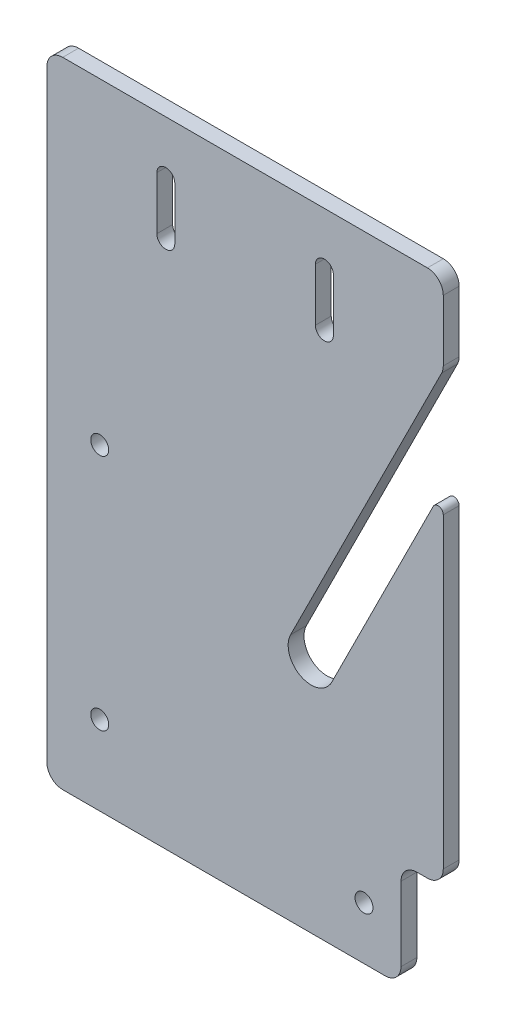
ISO-10303-21;
HEADER;
FILE_DESCRIPTION(('STEP AP214'),'2;1');
FILE_NAME('part.step','',(''),(''),'','','');
FILE_SCHEMA(('AUTOMOTIVE_DESIGN { 1 0 10303 214 1 1 1 1 }'));
ENDSEC;
DATA;
#1=APPLICATION_CONTEXT('core data for automotive mechanical design processes');
#2=APPLICATION_PROTOCOL_DEFINITION('international standard','automotive_design',2000,#1);
#3=PRODUCT_CONTEXT('',#1,'mechanical');
#4=PRODUCT('Part','Part','',(#3));
#5=PRODUCT_RELATED_PRODUCT_CATEGORY('part','',(#4));
#6=PRODUCT_DEFINITION_FORMATION('','',#4);
#7=PRODUCT_DEFINITION_CONTEXT('part definition',#1,'design');
#8=PRODUCT_DEFINITION('design','',#6,#7);
#9=PRODUCT_DEFINITION_SHAPE('','',#8);
#10=(LENGTH_UNIT() NAMED_UNIT(*) SI_UNIT(.MILLI.,.METRE.));
#11=(NAMED_UNIT(*) PLANE_ANGLE_UNIT() SI_UNIT($,.RADIAN.));
#12=(NAMED_UNIT(*) SI_UNIT($,.STERADIAN.) SOLID_ANGLE_UNIT());
#13=UNCERTAINTY_MEASURE_WITH_UNIT(LENGTH_MEASURE(1.E-05),#10,'distance_accuracy_value','');
#14=(GEOMETRIC_REPRESENTATION_CONTEXT(3) GLOBAL_UNCERTAINTY_ASSIGNED_CONTEXT((#13)) GLOBAL_UNIT_ASSIGNED_CONTEXT((#10,
#11,#12)) REPRESENTATION_CONTEXT('',''));
#15=CARTESIAN_POINT('',(0.,0.,0.));
#16=DIRECTION('',(0.,0.,1.));
#17=DIRECTION('',(1.,0.,0.));
#18=AXIS2_PLACEMENT_3D('',#15,#16,#17);
#19=CARTESIAN_POINT('',(50.,-75.,3.));
#20=DIRECTION('',(0.,0.,-1.));
#21=DIRECTION('',(-1.,0.,0.));
#22=AXIS2_PLACEMENT_3D('',#19,#20,#21);
#23=CYLINDRICAL_SURFACE('',#22,4.35);
#24=CARTESIAN_POINT('',(50.,-75.,0.));
#25=DIRECTION('',(0.,0.,1.));
#26=DIRECTION('',(1.,0.,0.));
#27=AXIS2_PLACEMENT_3D('',#24,#25,#26);
#28=CIRCLE('',#27,4.35);
#29=CARTESIAN_POINT('',(46.1092417191504,-73.0546208595752,0.));
#30=VERTEX_POINT('',#29);
#31=CARTESIAN_POINT('',(53.8907582808496,-76.9453791404248,0.));
#32=VERTEX_POINT('',#31);
#33=EDGE_CURVE('E329',#30,#32,#28,.T.);
#34=ORIENTED_EDGE('',*,*,#33,.F.);
#35=DIRECTION('',(0.,0.,-1.));
#36=VECTOR('',#35,1.);
#37=CARTESIAN_POINT('',(46.1092417191504,-73.0546208595752,3.));
#38=LINE('',#37,#36);
#39=CARTESIAN_POINT('',(46.1092417191504,-73.0546208595752,3.));
#40=VERTEX_POINT('',#39);
#41=EDGE_CURVE('E348',#40,#30,#38,.T.);
#42=ORIENTED_EDGE('',*,*,#41,.F.);
#43=CARTESIAN_POINT('',(50.,-75.,3.));
#44=DIRECTION('',(0.,0.,1.));
#45=DIRECTION('',(1.,0.,0.));
#46=AXIS2_PLACEMENT_3D('',#43,#44,#45);
#47=CIRCLE('',#46,4.35);
#48=CARTESIAN_POINT('',(53.8907582808496,-76.9453791404248,3.));
#49=VERTEX_POINT('',#48);
#50=EDGE_CURVE('E300',#40,#49,#47,.T.);
#51=ORIENTED_EDGE('',*,*,#50,.T.);
#52=DIRECTION('',(0.,0.,-1.));
#53=VECTOR('',#52,1.);
#54=CARTESIAN_POINT('',(53.8907582808496,-76.9453791404248,3.));
#55=LINE('',#54,#53);
#56=EDGE_CURVE('E320',#49,#32,#55,.T.);
#57=ORIENTED_EDGE('',*,*,#56,.T.);
#58=EDGE_LOOP('',(#34,#42,#51,#57));
#59=FACE_BOUND('',#58,.T.);
#60=ADVANCED_FACE('F37',(#59),#23,.F.);
#61=CARTESIAN_POINT('',(66.1092417191504,-33.0546208595752,3.));
#62=DIRECTION('',(0.894427190999916,-0.447213595499958,0.));
#63=DIRECTION('',(0.447213595499958,0.894427190999916,0.));
#64=AXIS2_PLACEMENT_3D('',#61,#62,#63);
#65=PLANE('',#64);
#66=DIRECTION('',(-0.447213595499958,-0.894427190999916,0.));
#67=VECTOR('',#66,1.);
#68=CARTESIAN_POINT('',(66.1092417191504,-33.0546208595752,0.));
#69=LINE('',#68,#67);
#70=CARTESIAN_POINT('',(74.6832815729997,-15.9065411518764,0.));
#71=VERTEX_POINT('',#70);
#72=EDGE_CURVE('E332',#71,#30,#69,.T.);
#73=ORIENTED_EDGE('',*,*,#72,.F.);
#74=DIRECTION('',(0.,0.,-1.));
#75=VECTOR('',#74,1.);
#76=CARTESIAN_POINT('',(74.6832815729997,-15.9065411518764,3.));
#77=LINE('',#76,#75);
#78=CARTESIAN_POINT('',(74.6832815729997,-15.9065411518764,3.));
#79=VERTEX_POINT('',#78);
#80=EDGE_CURVE('E364',#71,#79,#77,.F.);
#81=ORIENTED_EDGE('',*,*,#80,.T.);
#82=DIRECTION('',(-0.447213595499958,-0.894427190999916,0.));
#83=VECTOR('',#82,1.);
#84=CARTESIAN_POINT('',(66.1092417191504,-33.0546208595752,3.));
#85=LINE('',#84,#83);
#86=EDGE_CURVE('E303',#79,#40,#85,.T.);
#87=ORIENTED_EDGE('',*,*,#86,.T.);
#88=ORIENTED_EDGE('',*,*,#41,.T.);
#89=EDGE_LOOP('',(#73,#81,#87,#88));
#90=FACE_BOUND('',#89,.T.);
#91=ADVANCED_FACE('F441',(#90),#65,.T.);
#92=CARTESIAN_POINT('',(75.,0.,3.));
#93=DIRECTION('',(-1.,0.,0.));
#94=DIRECTION('',(0.,0.,1.));
#95=AXIS2_PLACEMENT_3D('',#92,#93,#94);
#96=PLANE('',#95);
#97=DIRECTION('',(0.,1.,0.));
#98=VECTOR('',#97,1.);
#99=CARTESIAN_POINT('',(75.,0.,3.));
#100=LINE('',#99,#98);
#101=CARTESIAN_POINT('',(75.,-14.5649003653766,3.));
#102=VERTEX_POINT('',#101);
#103=CARTESIAN_POINT('',(75.,-3.,3.));
#104=VERTEX_POINT('',#103);
#105=EDGE_CURVE('E305',#102,#104,#100,.T.);
#106=ORIENTED_EDGE('',*,*,#105,.F.);
#107=DIRECTION('',(0.,0.,-1.));
#108=VECTOR('',#107,1.);
#109=CARTESIAN_POINT('',(75.,-14.5649003653766,0.));
#110=LINE('',#109,#108);
#111=CARTESIAN_POINT('',(75.,-14.5649003653766,0.));
#112=VERTEX_POINT('',#111);
#113=EDGE_CURVE('E353',#102,#112,#110,.T.);
#114=ORIENTED_EDGE('',*,*,#113,.T.);
#115=DIRECTION('',(0.,1.,0.));
#116=VECTOR('',#115,1.);
#117=CARTESIAN_POINT('',(75.,0.,0.));
#118=LINE('',#117,#116);
#119=CARTESIAN_POINT('',(75.,-3.,0.));
#120=VERTEX_POINT('',#119);
#121=EDGE_CURVE('E334',#112,#120,#118,.T.);
#122=ORIENTED_EDGE('',*,*,#121,.T.);
#123=DIRECTION('',(0.,0.,-1.));
#124=VECTOR('',#123,1.);
#125=CARTESIAN_POINT('',(75.,-3.,3.));
#126=LINE('',#125,#124);
#127=EDGE_CURVE('E351',#120,#104,#126,.F.);
#128=ORIENTED_EDGE('',*,*,#127,.T.);
#129=EDGE_LOOP('',(#106,#114,#122,#128));
#130=FACE_BOUND('',#129,.T.);
#131=ADVANCED_FACE('F446',(#130),#96,.F.);
#132=CARTESIAN_POINT('',(0.,0.,3.));
#133=DIRECTION('',(0.,-1.,0.));
#134=DIRECTION('',(1.,0.,0.));
#135=AXIS2_PLACEMENT_3D('',#132,#133,#134);
#136=PLANE('',#135);
#137=DIRECTION('',(-1.,0.,0.));
#138=VECTOR('',#137,1.);
#139=CARTESIAN_POINT('',(0.,0.,3.));
#140=LINE('',#139,#138);
#141=CARTESIAN_POINT('',(72.,0.,3.));
#142=VERTEX_POINT('',#141);
#143=CARTESIAN_POINT('',(3.,0.,3.));
#144=VERTEX_POINT('',#143);
#145=EDGE_CURVE('E310',#142,#144,#140,.T.);
#146=ORIENTED_EDGE('',*,*,#145,.F.);
#147=DIRECTION('',(0.,0.,-1.));
#148=VECTOR('',#147,1.);
#149=CARTESIAN_POINT('',(72.,0.,3.));
#150=LINE('',#149,#148);
#151=CARTESIAN_POINT('',(72.,0.,0.));
#152=VERTEX_POINT('',#151);
#153=EDGE_CURVE('E384',#142,#152,#150,.T.);
#154=ORIENTED_EDGE('',*,*,#153,.T.);
#155=DIRECTION('',(-1.,0.,0.));
#156=VECTOR('',#155,1.);
#157=CARTESIAN_POINT('',(0.,0.,0.));
#158=LINE('',#157,#156);
#159=CARTESIAN_POINT('',(3.,0.,0.));
#160=VERTEX_POINT('',#159);
#161=EDGE_CURVE('E338',#152,#160,#158,.T.);
#162=ORIENTED_EDGE('',*,*,#161,.T.);
#163=DIRECTION('',(0.,0.,-1.));
#164=VECTOR('',#163,1.);
#165=CARTESIAN_POINT('',(3.,0.,3.));
#166=LINE('',#165,#164);
#167=EDGE_CURVE('E382',#160,#144,#166,.F.);
#168=ORIENTED_EDGE('',*,*,#167,.T.);
#169=EDGE_LOOP('',(#146,#154,#162,#168));
#170=FACE_BOUND('',#169,.T.);
#171=ADVANCED_FACE('F528',(#170),#136,.F.);
#172=CARTESIAN_POINT('',(0.,0.,3.));
#173=DIRECTION('',(1.,0.,0.));
#174=DIRECTION('',(0.,1.,0.));
#175=AXIS2_PLACEMENT_3D('',#172,#173,#174);
#176=PLANE('',#175);
#177=DIRECTION('',(0.,-1.,0.));
#178=VECTOR('',#177,1.);
#179=CARTESIAN_POINT('',(0.,0.,0.));
#180=LINE('',#179,#178);
#181=CARTESIAN_POINT('',(0.,-3.,0.));
#182=VERTEX_POINT('',#181);
#183=CARTESIAN_POINT('',(0.,-117.,0.));
#184=VERTEX_POINT('',#183);
#185=EDGE_CURVE('E341',#182,#184,#180,.T.);
#186=ORIENTED_EDGE('',*,*,#185,.T.);
#187=DIRECTION('',(0.,0.,-1.));
#188=VECTOR('',#187,1.);
#189=CARTESIAN_POINT('',(0.,-117.,3.));
#190=LINE('',#189,#188);
#191=CARTESIAN_POINT('',(0.,-117.,3.));
#192=VERTEX_POINT('',#191);
#193=EDGE_CURVE('E380',#184,#192,#190,.F.);
#194=ORIENTED_EDGE('',*,*,#193,.T.);
#195=DIRECTION('',(0.,-1.,0.));
#196=VECTOR('',#195,1.);
#197=CARTESIAN_POINT('',(0.,0.,3.));
#198=LINE('',#197,#196);
#199=CARTESIAN_POINT('',(0.,-3.,3.));
#200=VERTEX_POINT('',#199);
#201=EDGE_CURVE('E313',#200,#192,#198,.T.);
#202=ORIENTED_EDGE('',*,*,#201,.F.);
#203=DIRECTION('',(0.,0.,-1.));
#204=VECTOR('',#203,1.);
#205=CARTESIAN_POINT('',(0.,-3.,3.));
#206=LINE('',#205,#204);
#207=EDGE_CURVE('E377',#200,#182,#206,.T.);
#208=ORIENTED_EDGE('',*,*,#207,.T.);
#209=EDGE_LOOP('',(#186,#194,#202,#208));
#210=FACE_BOUND('',#209,.T.);
#211=ADVANCED_FACE('F520',(#210),#176,.F.);
#212=CARTESIAN_POINT('',(0.,-120.,3.));
#213=DIRECTION('',(0.,1.,0.));
#214=DIRECTION('',(0.,0.,1.));
#215=AXIS2_PLACEMENT_3D('',#212,#213,#214);
#216=PLANE('',#215);
#217=DIRECTION('',(1.,0.,0.));
#218=VECTOR('',#217,1.);
#219=CARTESIAN_POINT('',(0.,-120.,0.));
#220=LINE('',#219,#218);
#221=CARTESIAN_POINT('',(3.00000000000001,-120.,0.));
#222=VERTEX_POINT('',#221);
#223=CARTESIAN_POINT('',(64.,-120.,0.));
#224=VERTEX_POINT('',#223);
#225=EDGE_CURVE('E337',#222,#224,#220,.T.);
#226=ORIENTED_EDGE('',*,*,#225,.T.);
#227=DIRECTION('',(0.,0.,1.));
#228=VECTOR('',#227,1.);
#229=CARTESIAN_POINT('',(64.,-120.,3.));
#230=LINE('',#229,#228);
#231=CARTESIAN_POINT('',(64.,-120.,3.));
#232=VERTEX_POINT('',#231);
#233=EDGE_CURVE('E407',#224,#232,#230,.T.);
#234=ORIENTED_EDGE('',*,*,#233,.T.);
#235=DIRECTION('',(1.,0.,0.));
#236=VECTOR('',#235,1.);
#237=CARTESIAN_POINT('',(0.,-120.,3.));
#238=LINE('',#237,#236);
#239=CARTESIAN_POINT('',(3.00000000000001,-120.,3.));
#240=VERTEX_POINT('',#239);
#241=EDGE_CURVE('E309',#240,#232,#238,.T.);
#242=ORIENTED_EDGE('',*,*,#241,.F.);
#243=DIRECTION('',(0.,0.,-1.));
#244=VECTOR('',#243,1.);
#245=CARTESIAN_POINT('',(3.00000000000001,-120.,3.));
#246=LINE('',#245,#244);
#247=EDGE_CURVE('E374',#240,#222,#246,.T.);
#248=ORIENTED_EDGE('',*,*,#247,.T.);
#249=EDGE_LOOP('',(#226,#234,#242,#248));
#250=FACE_BOUND('',#249,.T.);
#251=ADVANCED_FACE('F513',(#250),#216,.F.);
#252=CARTESIAN_POINT('',(75.,-97.,0.));
#253=VERTEX_POINT('',#252);
#254=CARTESIAN_POINT('',(75.,-38.9629636796239,0.));
#255=VERTEX_POINT('',#254);
#256=EDGE_CURVE('E335',#253,#255,#118,.T.);
#257=ORIENTED_EDGE('',*,*,#256,.T.);
#258=DIRECTION('',(0.,0.,-1.));
#259=VECTOR('',#258,1.);
#260=CARTESIAN_POINT('',(75.,-38.9629636796239,3.));
#261=LINE('',#260,#259);
#262=CARTESIAN_POINT('',(75.,-38.9629636796239,3.));
#263=VERTEX_POINT('',#262);
#264=EDGE_CURVE('E45',#255,#263,#261,.F.);
#265=ORIENTED_EDGE('',*,*,#264,.T.);
#266=CARTESIAN_POINT('',(75.,-97.,3.));
#267=VERTEX_POINT('',#266);
#268=EDGE_CURVE('E306',#267,#263,#100,.T.);
#269=ORIENTED_EDGE('',*,*,#268,.F.);
#270=DIRECTION('',(0.,0.,1.));
#271=VECTOR('',#270,1.);
#272=CARTESIAN_POINT('',(75.,-97.,3.));
#273=LINE('',#272,#271);
#274=EDGE_CURVE('E396',#267,#253,#273,.F.);
#275=ORIENTED_EDGE('',*,*,#274,.T.);
#276=EDGE_LOOP('',(#257,#265,#269,#275));
#277=FACE_BOUND('',#276,.T.);
#278=ADVANCED_FACE('F455',(#277),#96,.F.);
#279=CARTESIAN_POINT('',(60.,-110.,3.));
#280=DIRECTION('',(0.,0.,-1.));
#281=DIRECTION('',(-1.,0.,0.));
#282=AXIS2_PLACEMENT_3D('',#279,#280,#281);
#283=CYLINDRICAL_SURFACE('',#282,1.7);
#284=CARTESIAN_POINT('',(60.,-110.,3.));
#285=DIRECTION('',(0.,0.,1.));
#286=DIRECTION('',(1.,0.,0.));
#287=AXIS2_PLACEMENT_3D('',#284,#285,#286);
#288=CIRCLE('',#287,1.7);
#289=CARTESIAN_POINT('',(61.7,-110.,3.));
#290=VERTEX_POINT('',#289);
#291=EDGE_CURVE('E297',#290,#290,#288,.T.);
#292=ORIENTED_EDGE('',*,*,#291,.T.);
#293=EDGE_LOOP('',(#292));
#294=FACE_BOUND('',#293,.T.);
#295=CARTESIAN_POINT('',(60.,-110.,0.));
#296=DIRECTION('',(0.,0.,1.));
#297=DIRECTION('',(1.,0.,0.));
#298=AXIS2_PLACEMENT_3D('',#295,#296,#297);
#299=CIRCLE('',#298,1.7);
#300=CARTESIAN_POINT('',(61.7,-110.,0.));
#301=VERTEX_POINT('',#300);
#302=EDGE_CURVE('E326',#301,#301,#299,.T.);
#303=ORIENTED_EDGE('',*,*,#302,.F.);
#304=EDGE_LOOP('',(#303));
#305=FACE_BOUND('',#304,.T.);
#306=ADVANCED_FACE('F451',(#294,#305),#283,.F.);
#307=CARTESIAN_POINT('',(10.,-60.,3.));
#308=DIRECTION('',(0.,0.,-1.));
#309=DIRECTION('',(-1.,0.,0.));
#310=AXIS2_PLACEMENT_3D('',#307,#308,#309);
#311=CYLINDRICAL_SURFACE('',#310,1.7);
#312=CARTESIAN_POINT('',(10.,-60.,3.));
#313=DIRECTION('',(0.,0.,1.));
#314=DIRECTION('',(1.,0.,0.));
#315=AXIS2_PLACEMENT_3D('',#312,#313,#314);
#316=CIRCLE('',#315,1.7);
#317=CARTESIAN_POINT('',(11.7,-60.,3.));
#318=VERTEX_POINT('',#317);
#319=EDGE_CURVE('E293',#318,#318,#316,.T.);
#320=ORIENTED_EDGE('',*,*,#319,.T.);
#321=EDGE_LOOP('',(#320));
#322=FACE_BOUND('',#321,.T.);
#323=CARTESIAN_POINT('',(10.,-60.,0.));
#324=DIRECTION('',(0.,0.,1.));
#325=DIRECTION('',(1.,0.,0.));
#326=AXIS2_PLACEMENT_3D('',#323,#324,#325);
#327=CIRCLE('',#326,1.7);
#328=CARTESIAN_POINT('',(11.7,-60.,0.));
#329=VERTEX_POINT('',#328);
#330=EDGE_CURVE('E323',#329,#329,#327,.T.);
#331=ORIENTED_EDGE('',*,*,#330,.F.);
#332=EDGE_LOOP('',(#331));
#333=FACE_BOUND('',#332,.T.);
#334=ADVANCED_FACE('F454',(#322,#333),#311,.F.);
#335=CARTESIAN_POINT('',(10.,-105.,3.));
#336=DIRECTION('',(0.,0.,-1.));
#337=DIRECTION('',(-1.,0.,0.));
#338=AXIS2_PLACEMENT_3D('',#335,#336,#337);
#339=CYLINDRICAL_SURFACE('',#338,1.7);
#340=CARTESIAN_POINT('',(10.,-105.,3.));
#341=DIRECTION('',(0.,0.,1.));
#342=DIRECTION('',(1.,0.,0.));
#343=AXIS2_PLACEMENT_3D('',#340,#341,#342);
#344=CIRCLE('',#343,1.7);
#345=CARTESIAN_POINT('',(11.7,-105.,3.));
#346=VERTEX_POINT('',#345);
#347=EDGE_CURVE('E290',#346,#346,#344,.T.);
#348=ORIENTED_EDGE('',*,*,#347,.T.);
#349=EDGE_LOOP('',(#348));
#350=FACE_BOUND('',#349,.T.);
#351=CARTESIAN_POINT('',(10.,-105.,0.));
#352=DIRECTION('',(0.,0.,1.));
#353=DIRECTION('',(1.,0.,0.));
#354=AXIS2_PLACEMENT_3D('',#351,#352,#353);
#355=CIRCLE('',#354,1.7);
#356=CARTESIAN_POINT('',(11.7,-105.,0.));
#357=VERTEX_POINT('',#356);
#358=EDGE_CURVE('E283',#357,#357,#355,.T.);
#359=ORIENTED_EDGE('',*,*,#358,.F.);
#360=EDGE_LOOP('',(#359));
#361=FACE_BOUND('',#360,.T.);
#362=ADVANCED_FACE('F459',(#350,#361),#339,.F.);
#363=CARTESIAN_POINT('',(73.8907582808497,-36.9453791404248,3.));
#364=DIRECTION('',(-0.894427190999916,0.447213595499958,0.));
#365=DIRECTION('',(-0.447213595499958,-0.894427190999916,0.));
#366=AXIS2_PLACEMENT_3D('',#363,#364,#365);
#367=PLANE('',#366);
#368=DIRECTION('',(0.447213595499958,0.894427190999916,0.));
#369=VECTOR('',#368,1.);
#370=CARTESIAN_POINT('',(73.8907582808497,-36.9453791404248,3.));
#371=LINE('',#370,#369);
#372=CARTESIAN_POINT('',(73.1055728090001,-38.5157500841239,3.));
#373=VERTEX_POINT('',#372);
#374=EDGE_CURVE('E308',#49,#373,#371,.T.);
#375=ORIENTED_EDGE('',*,*,#374,.T.);
#376=DIRECTION('',(0.,0.,-1.));
#377=VECTOR('',#376,1.);
#378=CARTESIAN_POINT('',(73.1055728090001,-38.5157500841239,0.));
#379=LINE('',#378,#377);
#380=CARTESIAN_POINT('',(73.1055728090001,-38.5157500841239,0.));
#381=VERTEX_POINT('',#380);
#382=EDGE_CURVE('E414',#373,#381,#379,.T.);
#383=ORIENTED_EDGE('',*,*,#382,.T.);
#384=DIRECTION('',(0.447213595499958,0.894427190999916,0.));
#385=VECTOR('',#384,1.);
#386=CARTESIAN_POINT('',(73.8907582808497,-36.9453791404248,0.));
#387=LINE('',#386,#385);
#388=EDGE_CURVE('E294',#32,#381,#387,.T.);
#389=ORIENTED_EDGE('',*,*,#388,.F.);
#390=ORIENTED_EDGE('',*,*,#56,.F.);
#391=EDGE_LOOP('',(#375,#383,#389,#390));
#392=FACE_BOUND('',#391,.T.);
#393=ADVANCED_FACE('F420',(#392),#367,.T.);
#394=CARTESIAN_POINT('',(0.,0.,3.));
#395=DIRECTION('',(0.,0.,1.));
#396=DIRECTION('',(1.,0.,0.));
#397=AXIS2_PLACEMENT_3D('',#394,#395,#396);
#398=PLANE('',#397);
#399=ORIENTED_EDGE('',*,*,#268,.T.);
#400=CARTESIAN_POINT('',(74.,-38.9629636796239,3.));
#401=DIRECTION('',(0.,0.,1.));
#402=DIRECTION('',(1.,0.,0.));
#403=AXIS2_PLACEMENT_3D('',#400,#401,#402);
#404=CIRCLE('',#403,1.);
#405=EDGE_CURVE('E11',#263,#373,#404,.T.);
#406=ORIENTED_EDGE('',*,*,#405,.T.);
#407=ORIENTED_EDGE('',*,*,#374,.F.);
#408=ORIENTED_EDGE('',*,*,#50,.F.);
#409=ORIENTED_EDGE('',*,*,#86,.F.);
#410=CARTESIAN_POINT('',(72.,-14.5649003653766,3.));
#411=DIRECTION('',(0.,0.,1.));
#412=DIRECTION('',(1.,0.,0.));
#413=AXIS2_PLACEMENT_3D('',#410,#411,#412);
#414=CIRCLE('',#413,3.);
#415=EDGE_CURVE('E372',#79,#102,#414,.T.);
#416=ORIENTED_EDGE('',*,*,#415,.T.);
#417=ORIENTED_EDGE('',*,*,#105,.T.);
#418=CARTESIAN_POINT('',(72.,-3.,3.));
#419=DIRECTION('',(0.,0.,1.));
#420=DIRECTION('',(1.,0.,0.));
#421=AXIS2_PLACEMENT_3D('',#418,#419,#420);
#422=CIRCLE('',#421,3.);
#423=EDGE_CURVE('E368',#104,#142,#422,.T.);
#424=ORIENTED_EDGE('',*,*,#423,.T.);
#425=ORIENTED_EDGE('',*,*,#145,.T.);
#426=CARTESIAN_POINT('',(3.,-3.,3.));
#427=DIRECTION('',(0.,0.,1.));
#428=DIRECTION('',(1.,0.,0.));
#429=AXIS2_PLACEMENT_3D('',#426,#427,#428);
#430=CIRCLE('',#429,3.);
#431=EDGE_CURVE('E366',#144,#200,#430,.T.);
#432=ORIENTED_EDGE('',*,*,#431,.T.);
#433=ORIENTED_EDGE('',*,*,#201,.T.);
#434=CARTESIAN_POINT('',(3.00000000000001,-117.,3.));
#435=DIRECTION('',(0.,0.,1.));
#436=DIRECTION('',(1.,0.,0.));
#437=AXIS2_PLACEMENT_3D('',#434,#435,#436);
#438=CIRCLE('',#437,3.);
#439=EDGE_CURVE('E370',#192,#240,#438,.T.);
#440=ORIENTED_EDGE('',*,*,#439,.T.);
#441=ORIENTED_EDGE('',*,*,#241,.T.);
#442=CARTESIAN_POINT('',(64.,-117.,3.));
#443=DIRECTION('',(0.,0.,1.));
#444=DIRECTION('',(1.,0.,0.));
#445=AXIS2_PLACEMENT_3D('',#442,#443,#444);
#446=CIRCLE('',#445,3.);
#447=CARTESIAN_POINT('',(67.,-117.,3.));
#448=VERTEX_POINT('',#447);
#449=EDGE_CURVE('E392',#232,#448,#446,.T.);
#450=ORIENTED_EDGE('',*,*,#449,.T.);
#451=DIRECTION('',(0.,-1.,0.));
#452=VECTOR('',#451,1.);
#453=CARTESIAN_POINT('',(67.,-100.,3.));
#454=LINE('',#453,#452);
#455=CARTESIAN_POINT('',(67.,-103.,3.));
#456=VERTEX_POINT('',#455);
#457=EDGE_CURVE('E241',#456,#448,#454,.T.);
#458=ORIENTED_EDGE('',*,*,#457,.F.);
#459=CARTESIAN_POINT('',(70.,-103.,3.));
#460=DIRECTION('',(0.,0.,1.));
#461=DIRECTION('',(1.,0.,0.));
#462=AXIS2_PLACEMENT_3D('',#459,#460,#461);
#463=CIRCLE('',#462,3.);
#464=CARTESIAN_POINT('',(70.,-100.,3.));
#465=VERTEX_POINT('',#464);
#466=EDGE_CURVE('E410',#456,#465,#463,.F.);
#467=ORIENTED_EDGE('',*,*,#466,.T.);
#468=DIRECTION('',(-1.,0.,0.));
#469=VECTOR('',#468,1.);
#470=CARTESIAN_POINT('',(75.,-100.,3.));
#471=LINE('',#470,#469);
#472=CARTESIAN_POINT('',(72.,-100.,3.));
#473=VERTEX_POINT('',#472);
#474=EDGE_CURVE('E506',#473,#465,#471,.T.);
#475=ORIENTED_EDGE('',*,*,#474,.F.);
#476=CARTESIAN_POINT('',(72.,-97.,3.));
#477=DIRECTION('',(0.,0.,1.));
#478=DIRECTION('',(1.,0.,0.));
#479=AXIS2_PLACEMENT_3D('',#476,#477,#478);
#480=CIRCLE('',#479,3.);
#481=EDGE_CURVE('E394',#473,#267,#480,.T.);
#482=ORIENTED_EDGE('',*,*,#481,.T.);
#483=EDGE_LOOP('',(#399,#406,#407,#408,#409,#416,#417,#424,#425,#432,#433,#440,#441,#450,#458,
#467,#475,#482));
#484=FACE_BOUND('',#483,.T.);
#485=CARTESIAN_POINT('',(52.5,-10.,3.));
#486=DIRECTION('',(0.,0.,1.));
#487=DIRECTION('',(1.,0.,0.));
#488=AXIS2_PLACEMENT_3D('',#485,#486,#487);
#489=CIRCLE('',#488,1.7);
#490=CARTESIAN_POINT('',(54.2,-10.,3.));
#491=VERTEX_POINT('',#490);
#492=CARTESIAN_POINT('',(50.8,-10.,3.));
#493=VERTEX_POINT('',#492);
#494=EDGE_CURVE('E217',#491,#493,#489,.T.);
#495=ORIENTED_EDGE('',*,*,#494,.F.);
#496=DIRECTION('',(0.,1.,0.));
#497=VECTOR('',#496,1.);
#498=CARTESIAN_POINT('',(54.2,-10.,3.));
#499=LINE('',#498,#497);
#500=CARTESIAN_POINT('',(54.2,-20.,3.));
#501=VERTEX_POINT('',#500);
#502=EDGE_CURVE('E235',#501,#491,#499,.T.);
#503=ORIENTED_EDGE('',*,*,#502,.F.);
#504=CARTESIAN_POINT('',(52.5,-20.,3.));
#505=DIRECTION('',(0.,0.,1.));
#506=DIRECTION('',(1.,0.,0.));
#507=AXIS2_PLACEMENT_3D('',#504,#505,#506);
#508=CIRCLE('',#507,1.7);
#509=CARTESIAN_POINT('',(50.8,-20.,3.));
#510=VERTEX_POINT('',#509);
#511=EDGE_CURVE('E238',#510,#501,#508,.T.);
#512=ORIENTED_EDGE('',*,*,#511,.F.);
#513=DIRECTION('',(0.,-1.,0.));
#514=VECTOR('',#513,1.);
#515=CARTESIAN_POINT('',(50.8,-10.,3.));
#516=LINE('',#515,#514);
#517=EDGE_CURVE('E247',#493,#510,#516,.T.);
#518=ORIENTED_EDGE('',*,*,#517,.F.);
#519=EDGE_LOOP('',(#495,#503,#512,#518));
#520=FACE_BOUND('',#519,.T.);
#521=CARTESIAN_POINT('',(22.5,-10.,3.));
#522=DIRECTION('',(0.,0.,1.));
#523=DIRECTION('',(1.,0.,0.));
#524=AXIS2_PLACEMENT_3D('',#521,#522,#523);
#525=CIRCLE('',#524,1.7);
#526=CARTESIAN_POINT('',(24.2,-10.,3.));
#527=VERTEX_POINT('',#526);
#528=CARTESIAN_POINT('',(20.8,-10.,3.));
#529=VERTEX_POINT('',#528);
#530=EDGE_CURVE('E254',#527,#529,#525,.T.);
#531=ORIENTED_EDGE('',*,*,#530,.F.);
#532=DIRECTION('',(0.,1.,0.));
#533=VECTOR('',#532,1.);
#534=CARTESIAN_POINT('',(24.2,-10.,3.));
#535=LINE('',#534,#533);
#536=CARTESIAN_POINT('',(24.2,-20.,3.));
#537=VERTEX_POINT('',#536);
#538=EDGE_CURVE('E262',#537,#527,#535,.T.);
#539=ORIENTED_EDGE('',*,*,#538,.F.);
#540=CARTESIAN_POINT('',(22.5,-20.,3.));
#541=DIRECTION('',(0.,0.,1.));
#542=DIRECTION('',(1.,0.,0.));
#543=AXIS2_PLACEMENT_3D('',#540,#541,#542);
#544=CIRCLE('',#543,1.7);
#545=CARTESIAN_POINT('',(20.8,-20.,3.));
#546=VERTEX_POINT('',#545);
#547=EDGE_CURVE('E276',#546,#537,#544,.T.);
#548=ORIENTED_EDGE('',*,*,#547,.F.);
#549=DIRECTION('',(0.,-1.,0.));
#550=VECTOR('',#549,1.);
#551=CARTESIAN_POINT('',(20.8,-10.,3.));
#552=LINE('',#551,#550);
#553=EDGE_CURVE('E273',#529,#546,#552,.T.);
#554=ORIENTED_EDGE('',*,*,#553,.F.);
#555=EDGE_LOOP('',(#531,#539,#548,#554));
#556=FACE_BOUND('',#555,.T.);
#557=ORIENTED_EDGE('',*,*,#347,.F.);
#558=EDGE_LOOP('',(#557));
#559=FACE_BOUND('',#558,.T.);
#560=ORIENTED_EDGE('',*,*,#319,.F.);
#561=EDGE_LOOP('',(#560));
#562=FACE_BOUND('',#561,.T.);
#563=ORIENTED_EDGE('',*,*,#291,.F.);
#564=EDGE_LOOP('',(#563));
#565=FACE_BOUND('',#564,.T.);
#566=ADVANCED_FACE('F431',(#484,#520,#556,#559,#562,#565),#398,.T.);
#567=CARTESIAN_POINT('',(0.,0.,0.));
#568=DIRECTION('',(0.,0.,1.));
#569=DIRECTION('',(1.,0.,0.));
#570=AXIS2_PLACEMENT_3D('',#567,#568,#569);
#571=PLANE('',#570);
#572=DIRECTION('',(0.,1.,0.));
#573=VECTOR('',#572,1.);
#574=CARTESIAN_POINT('',(54.2,-10.,0.));
#575=LINE('',#574,#573);
#576=CARTESIAN_POINT('',(54.2,-20.,0.));
#577=VERTEX_POINT('',#576);
#578=CARTESIAN_POINT('',(54.2,-10.,0.));
#579=VERTEX_POINT('',#578);
#580=EDGE_CURVE('E222',#577,#579,#575,.T.);
#581=ORIENTED_EDGE('',*,*,#580,.T.);
#582=CARTESIAN_POINT('',(52.5,-10.,0.));
#583=DIRECTION('',(0.,0.,1.));
#584=DIRECTION('',(1.,0.,0.));
#585=AXIS2_PLACEMENT_3D('',#582,#583,#584);
#586=CIRCLE('',#585,1.7);
#587=CARTESIAN_POINT('',(50.8,-10.,0.));
#588=VERTEX_POINT('',#587);
#589=EDGE_CURVE('E214',#579,#588,#586,.T.);
#590=ORIENTED_EDGE('',*,*,#589,.T.);
#591=DIRECTION('',(0.,-1.,0.));
#592=VECTOR('',#591,1.);
#593=CARTESIAN_POINT('',(50.8,-10.,0.));
#594=LINE('',#593,#592);
#595=CARTESIAN_POINT('',(50.8,-20.,0.));
#596=VERTEX_POINT('',#595);
#597=EDGE_CURVE('E226',#588,#596,#594,.T.);
#598=ORIENTED_EDGE('',*,*,#597,.T.);
#599=CARTESIAN_POINT('',(52.5,-20.,0.));
#600=DIRECTION('',(0.,0.,1.));
#601=DIRECTION('',(1.,0.,0.));
#602=AXIS2_PLACEMENT_3D('',#599,#600,#601);
#603=CIRCLE('',#602,1.7);
#604=EDGE_CURVE('E230',#596,#577,#603,.T.);
#605=ORIENTED_EDGE('',*,*,#604,.T.);
#606=EDGE_LOOP('',(#581,#590,#598,#605));
#607=FACE_BOUND('',#606,.T.);
#608=DIRECTION('',(0.,1.,0.));
#609=VECTOR('',#608,1.);
#610=CARTESIAN_POINT('',(24.2,-10.,0.));
#611=LINE('',#610,#609);
#612=CARTESIAN_POINT('',(24.2,-20.,0.));
#613=VERTEX_POINT('',#612);
#614=CARTESIAN_POINT('',(24.2,-10.,0.));
#615=VERTEX_POINT('',#614);
#616=EDGE_CURVE('E268',#613,#615,#611,.T.);
#617=ORIENTED_EDGE('',*,*,#616,.T.);
#618=CARTESIAN_POINT('',(22.5,-10.,0.));
#619=DIRECTION('',(0.,0.,1.));
#620=DIRECTION('',(1.,0.,0.));
#621=AXIS2_PLACEMENT_3D('',#618,#619,#620);
#622=CIRCLE('',#621,1.7);
#623=CARTESIAN_POINT('',(20.8,-10.,0.));
#624=VERTEX_POINT('',#623);
#625=EDGE_CURVE('E258',#615,#624,#622,.T.);
#626=ORIENTED_EDGE('',*,*,#625,.T.);
#627=DIRECTION('',(0.,-1.,0.));
#628=VECTOR('',#627,1.);
#629=CARTESIAN_POINT('',(20.8,-10.,0.));
#630=LINE('',#629,#628);
#631=CARTESIAN_POINT('',(20.8,-20.,0.));
#632=VERTEX_POINT('',#631);
#633=EDGE_CURVE('E261',#624,#632,#630,.T.);
#634=ORIENTED_EDGE('',*,*,#633,.T.);
#635=CARTESIAN_POINT('',(22.5,-20.,0.));
#636=DIRECTION('',(0.,0.,1.));
#637=DIRECTION('',(1.,0.,0.));
#638=AXIS2_PLACEMENT_3D('',#635,#636,#637);
#639=CIRCLE('',#638,1.7);
#640=EDGE_CURVE('E265',#632,#613,#639,.T.);
#641=ORIENTED_EDGE('',*,*,#640,.T.);
#642=EDGE_LOOP('',(#617,#626,#634,#641));
#643=FACE_BOUND('',#642,.T.);
#644=ORIENTED_EDGE('',*,*,#358,.T.);
#645=EDGE_LOOP('',(#644));
#646=FACE_BOUND('',#645,.T.);
#647=ORIENTED_EDGE('',*,*,#330,.T.);
#648=EDGE_LOOP('',(#647));
#649=FACE_BOUND('',#648,.T.);
#650=ORIENTED_EDGE('',*,*,#302,.T.);
#651=EDGE_LOOP('',(#650));
#652=FACE_BOUND('',#651,.T.);
#653=ORIENTED_EDGE('',*,*,#388,.T.);
#654=CARTESIAN_POINT('',(74.,-38.9629636796239,0.));
#655=DIRECTION('',(0.,0.,1.));
#656=DIRECTION('',(1.,0.,0.));
#657=AXIS2_PLACEMENT_3D('',#654,#655,#656);
#658=CIRCLE('',#657,1.);
#659=EDGE_CURVE('E59',#381,#255,#658,.F.);
#660=ORIENTED_EDGE('',*,*,#659,.T.);
#661=ORIENTED_EDGE('',*,*,#256,.F.);
#662=CARTESIAN_POINT('',(72.,-97.,0.));
#663=DIRECTION('',(0.,0.,1.));
#664=DIRECTION('',(1.,0.,0.));
#665=AXIS2_PLACEMENT_3D('',#662,#663,#664);
#666=CIRCLE('',#665,3.);
#667=CARTESIAN_POINT('',(72.,-100.,0.));
#668=VERTEX_POINT('',#667);
#669=EDGE_CURVE('E400',#253,#668,#666,.F.);
#670=ORIENTED_EDGE('',*,*,#669,.T.);
#671=DIRECTION('',(-1.,0.,0.));
#672=VECTOR('',#671,1.);
#673=CARTESIAN_POINT('',(75.,-100.,0.));
#674=LINE('',#673,#672);
#675=CARTESIAN_POINT('',(70.,-100.,0.));
#676=VERTEX_POINT('',#675);
#677=EDGE_CURVE('E498',#668,#676,#674,.T.);
#678=ORIENTED_EDGE('',*,*,#677,.T.);
#679=CARTESIAN_POINT('',(70.,-103.,0.));
#680=DIRECTION('',(0.,0.,1.));
#681=DIRECTION('',(1.,0.,0.));
#682=AXIS2_PLACEMENT_3D('',#679,#680,#681);
#683=CIRCLE('',#682,3.);
#684=CARTESIAN_POINT('',(67.,-103.,0.));
#685=VERTEX_POINT('',#684);
#686=EDGE_CURVE('E412',#676,#685,#683,.T.);
#687=ORIENTED_EDGE('',*,*,#686,.T.);
#688=DIRECTION('',(0.,-1.,0.));
#689=VECTOR('',#688,1.);
#690=CARTESIAN_POINT('',(67.,-100.,0.));
#691=LINE('',#690,#689);
#692=CARTESIAN_POINT('',(67.,-117.,0.));
#693=VERTEX_POINT('',#692);
#694=EDGE_CURVE('E248',#685,#693,#691,.T.);
#695=ORIENTED_EDGE('',*,*,#694,.T.);
#696=CARTESIAN_POINT('',(64.,-117.,0.));
#697=DIRECTION('',(0.,0.,1.));
#698=DIRECTION('',(1.,0.,0.));
#699=AXIS2_PLACEMENT_3D('',#696,#697,#698);
#700=CIRCLE('',#699,3.);
#701=EDGE_CURVE('E398',#693,#224,#700,.F.);
#702=ORIENTED_EDGE('',*,*,#701,.T.);
#703=ORIENTED_EDGE('',*,*,#225,.F.);
#704=CARTESIAN_POINT('',(3.00000000000001,-117.,0.));
#705=DIRECTION('',(0.,0.,1.));
#706=DIRECTION('',(1.,0.,0.));
#707=AXIS2_PLACEMENT_3D('',#704,#705,#706);
#708=CIRCLE('',#707,3.);
#709=EDGE_CURVE('E360',#222,#184,#708,.F.);
#710=ORIENTED_EDGE('',*,*,#709,.T.);
#711=ORIENTED_EDGE('',*,*,#185,.F.);
#712=CARTESIAN_POINT('',(3.,-3.,0.));
#713=DIRECTION('',(0.,0.,1.));
#714=DIRECTION('',(1.,0.,0.));
#715=AXIS2_PLACEMENT_3D('',#712,#713,#714);
#716=CIRCLE('',#715,3.);
#717=EDGE_CURVE('E356',#182,#160,#716,.F.);
#718=ORIENTED_EDGE('',*,*,#717,.T.);
#719=ORIENTED_EDGE('',*,*,#161,.F.);
#720=CARTESIAN_POINT('',(72.,-3.,0.));
#721=DIRECTION('',(0.,0.,1.));
#722=DIRECTION('',(1.,0.,0.));
#723=AXIS2_PLACEMENT_3D('',#720,#721,#722);
#724=CIRCLE('',#723,3.);
#725=EDGE_CURVE('E358',#152,#120,#724,.F.);
#726=ORIENTED_EDGE('',*,*,#725,.T.);
#727=ORIENTED_EDGE('',*,*,#121,.F.);
#728=CARTESIAN_POINT('',(72.,-14.5649003653766,0.));
#729=DIRECTION('',(0.,0.,1.));
#730=DIRECTION('',(1.,0.,0.));
#731=AXIS2_PLACEMENT_3D('',#728,#729,#730);
#732=CIRCLE('',#731,3.);
#733=EDGE_CURVE('E362',#112,#71,#732,.F.);
#734=ORIENTED_EDGE('',*,*,#733,.T.);
#735=ORIENTED_EDGE('',*,*,#72,.T.);
#736=ORIENTED_EDGE('',*,*,#33,.T.);
#737=EDGE_LOOP('',(#653,#660,#661,#670,#678,#687,#695,#702,#703,#710,#711,#718,#719,#726,#727,
#734,#735,#736));
#738=FACE_BOUND('',#737,.T.);
#739=ADVANCED_FACE('F232',(#607,#643,#646,#649,#652,#738),#571,.F.);
#740=CARTESIAN_POINT('',(72.,-14.5649003653766,3.));
#741=DIRECTION('',(0.,0.,1.));
#742=DIRECTION('',(1.,0.,0.));
#743=AXIS2_PLACEMENT_3D('',#740,#741,#742);
#744=CYLINDRICAL_SURFACE('',#743,3.);
#745=ORIENTED_EDGE('',*,*,#415,.F.);
#746=ORIENTED_EDGE('',*,*,#80,.F.);
#747=ORIENTED_EDGE('',*,*,#733,.F.);
#748=ORIENTED_EDGE('',*,*,#113,.F.);
#749=EDGE_LOOP('',(#745,#746,#747,#748));
#750=FACE_BOUND('',#749,.T.);
#751=ADVANCED_FACE('F464',(#750),#744,.T.);
#752=CARTESIAN_POINT('',(3.00000000000001,-117.,3.));
#753=DIRECTION('',(0.,0.,-1.));
#754=DIRECTION('',(-1.,0.,0.));
#755=AXIS2_PLACEMENT_3D('',#752,#753,#754);
#756=CYLINDRICAL_SURFACE('',#755,3.);
#757=ORIENTED_EDGE('',*,*,#439,.F.);
#758=ORIENTED_EDGE('',*,*,#193,.F.);
#759=ORIENTED_EDGE('',*,*,#709,.F.);
#760=ORIENTED_EDGE('',*,*,#247,.F.);
#761=EDGE_LOOP('',(#757,#758,#759,#760));
#762=FACE_BOUND('',#761,.T.);
#763=ADVANCED_FACE('F467',(#762),#756,.T.);
#764=CARTESIAN_POINT('',(72.,-3.,3.));
#765=DIRECTION('',(0.,0.,-1.));
#766=DIRECTION('',(-1.,0.,0.));
#767=AXIS2_PLACEMENT_3D('',#764,#765,#766);
#768=CYLINDRICAL_SURFACE('',#767,3.);
#769=ORIENTED_EDGE('',*,*,#423,.F.);
#770=ORIENTED_EDGE('',*,*,#127,.F.);
#771=ORIENTED_EDGE('',*,*,#725,.F.);
#772=ORIENTED_EDGE('',*,*,#153,.F.);
#773=EDGE_LOOP('',(#769,#770,#771,#772));
#774=FACE_BOUND('',#773,.T.);
#775=ADVANCED_FACE('F471',(#774),#768,.T.);
#776=CARTESIAN_POINT('',(3.,-3.,3.));
#777=DIRECTION('',(0.,0.,-1.));
#778=DIRECTION('',(-1.,0.,0.));
#779=AXIS2_PLACEMENT_3D('',#776,#777,#778);
#780=CYLINDRICAL_SURFACE('',#779,3.);
#781=ORIENTED_EDGE('',*,*,#431,.F.);
#782=ORIENTED_EDGE('',*,*,#167,.F.);
#783=ORIENTED_EDGE('',*,*,#717,.F.);
#784=ORIENTED_EDGE('',*,*,#207,.F.);
#785=EDGE_LOOP('',(#781,#782,#783,#784));
#786=FACE_BOUND('',#785,.T.);
#787=ADVANCED_FACE('F475',(#786),#780,.T.);
#788=CARTESIAN_POINT('',(22.5,-10.,0.));
#789=DIRECTION('',(0.,0.,1.));
#790=DIRECTION('',(1.,0.,0.));
#791=AXIS2_PLACEMENT_3D('',#788,#789,#790);
#792=CYLINDRICAL_SURFACE('',#791,1.7);
#793=ORIENTED_EDGE('',*,*,#530,.T.);
#794=DIRECTION('',(0.,0.,1.));
#795=VECTOR('',#794,1.);
#796=CARTESIAN_POINT('',(20.8,-10.,0.));
#797=LINE('',#796,#795);
#798=EDGE_CURVE('E271',#624,#529,#797,.T.);
#799=ORIENTED_EDGE('',*,*,#798,.F.);
#800=ORIENTED_EDGE('',*,*,#625,.F.);
#801=DIRECTION('',(0.,0.,1.));
#802=VECTOR('',#801,1.);
#803=CARTESIAN_POINT('',(24.2,-10.,0.));
#804=LINE('',#803,#802);
#805=EDGE_CURVE('E281',#615,#527,#804,.T.);
#806=ORIENTED_EDGE('',*,*,#805,.T.);
#807=EDGE_LOOP('',(#793,#799,#800,#806));
#808=FACE_BOUND('',#807,.T.);
#809=ADVANCED_FACE('F479',(#808),#792,.F.);
#810=CARTESIAN_POINT('',(24.2,-10.,0.));
#811=DIRECTION('',(1.,0.,0.));
#812=DIRECTION('',(0.,1.,0.));
#813=AXIS2_PLACEMENT_3D('',#810,#811,#812);
#814=PLANE('',#813);
#815=ORIENTED_EDGE('',*,*,#538,.T.);
#816=ORIENTED_EDGE('',*,*,#805,.F.);
#817=ORIENTED_EDGE('',*,*,#616,.F.);
#818=DIRECTION('',(0.,0.,1.));
#819=VECTOR('',#818,1.);
#820=CARTESIAN_POINT('',(24.2,-20.,0.));
#821=LINE('',#820,#819);
#822=EDGE_CURVE('E284',#613,#537,#821,.T.);
#823=ORIENTED_EDGE('',*,*,#822,.T.);
#824=EDGE_LOOP('',(#815,#816,#817,#823));
#825=FACE_BOUND('',#824,.T.);
#826=ADVANCED_FACE('F574',(#825),#814,.F.);
#827=CARTESIAN_POINT('',(22.5,-20.,0.));
#828=DIRECTION('',(0.,0.,1.));
#829=DIRECTION('',(1.,0.,0.));
#830=AXIS2_PLACEMENT_3D('',#827,#828,#829);
#831=CYLINDRICAL_SURFACE('',#830,1.7);
#832=ORIENTED_EDGE('',*,*,#547,.T.);
#833=ORIENTED_EDGE('',*,*,#822,.F.);
#834=ORIENTED_EDGE('',*,*,#640,.F.);
#835=DIRECTION('',(0.,0.,1.));
#836=VECTOR('',#835,1.);
#837=CARTESIAN_POINT('',(20.8,-20.,0.));
#838=LINE('',#837,#836);
#839=EDGE_CURVE('E286',#632,#546,#838,.T.);
#840=ORIENTED_EDGE('',*,*,#839,.T.);
#841=EDGE_LOOP('',(#832,#833,#834,#840));
#842=FACE_BOUND('',#841,.T.);
#843=ADVANCED_FACE('F577',(#842),#831,.F.);
#844=CARTESIAN_POINT('',(20.8,-10.,0.));
#845=DIRECTION('',(-1.,0.,0.));
#846=DIRECTION('',(0.,-1.,0.));
#847=AXIS2_PLACEMENT_3D('',#844,#845,#846);
#848=PLANE('',#847);
#849=ORIENTED_EDGE('',*,*,#553,.T.);
#850=ORIENTED_EDGE('',*,*,#839,.F.);
#851=ORIENTED_EDGE('',*,*,#633,.F.);
#852=ORIENTED_EDGE('',*,*,#798,.T.);
#853=EDGE_LOOP('',(#849,#850,#851,#852));
#854=FACE_BOUND('',#853,.T.);
#855=ADVANCED_FACE('F573',(#854),#848,.F.);
#856=CARTESIAN_POINT('',(52.5,-10.,0.));
#857=DIRECTION('',(0.,0.,1.));
#858=DIRECTION('',(1.,0.,0.));
#859=AXIS2_PLACEMENT_3D('',#856,#857,#858);
#860=CYLINDRICAL_SURFACE('',#859,1.7);
#861=ORIENTED_EDGE('',*,*,#494,.T.);
#862=DIRECTION('',(0.,0.,1.));
#863=VECTOR('',#862,1.);
#864=CARTESIAN_POINT('',(50.8,-10.,0.));
#865=LINE('',#864,#863);
#866=EDGE_CURVE('E210',#588,#493,#865,.T.);
#867=ORIENTED_EDGE('',*,*,#866,.F.);
#868=ORIENTED_EDGE('',*,*,#589,.F.);
#869=DIRECTION('',(0.,0.,1.));
#870=VECTOR('',#869,1.);
#871=CARTESIAN_POINT('',(54.2,-10.,0.));
#872=LINE('',#871,#870);
#873=EDGE_CURVE('E252',#579,#491,#872,.T.);
#874=ORIENTED_EDGE('',*,*,#873,.T.);
#875=EDGE_LOOP('',(#861,#867,#868,#874));
#876=FACE_BOUND('',#875,.T.);
#877=ADVANCED_FACE('F212',(#876),#860,.F.);
#878=CARTESIAN_POINT('',(54.2,-10.,0.));
#879=DIRECTION('',(1.,0.,0.));
#880=DIRECTION('',(0.,1.,0.));
#881=AXIS2_PLACEMENT_3D('',#878,#879,#880);
#882=PLANE('',#881);
#883=ORIENTED_EDGE('',*,*,#502,.T.);
#884=ORIENTED_EDGE('',*,*,#873,.F.);
#885=ORIENTED_EDGE('',*,*,#580,.F.);
#886=DIRECTION('',(0.,0.,1.));
#887=VECTOR('',#886,1.);
#888=CARTESIAN_POINT('',(54.2,-20.,0.));
#889=LINE('',#888,#887);
#890=EDGE_CURVE('E255',#577,#501,#889,.T.);
#891=ORIENTED_EDGE('',*,*,#890,.T.);
#892=EDGE_LOOP('',(#883,#884,#885,#891));
#893=FACE_BOUND('',#892,.T.);
#894=ADVANCED_FACE('F561',(#893),#882,.F.);
#895=CARTESIAN_POINT('',(52.5,-20.,0.));
#896=DIRECTION('',(0.,0.,1.));
#897=DIRECTION('',(1.,0.,0.));
#898=AXIS2_PLACEMENT_3D('',#895,#896,#897);
#899=CYLINDRICAL_SURFACE('',#898,1.7);
#900=ORIENTED_EDGE('',*,*,#511,.T.);
#901=ORIENTED_EDGE('',*,*,#890,.F.);
#902=ORIENTED_EDGE('',*,*,#604,.F.);
#903=DIRECTION('',(0.,0.,1.));
#904=VECTOR('',#903,1.);
#905=CARTESIAN_POINT('',(50.8,-20.,0.));
#906=LINE('',#905,#904);
#907=EDGE_CURVE('E221',#596,#510,#906,.T.);
#908=ORIENTED_EDGE('',*,*,#907,.T.);
#909=EDGE_LOOP('',(#900,#901,#902,#908));
#910=FACE_BOUND('',#909,.T.);
#911=ADVANCED_FACE('F564',(#910),#899,.F.);
#912=CARTESIAN_POINT('',(50.8,-10.,0.));
#913=DIRECTION('',(-1.,0.,0.));
#914=DIRECTION('',(0.,-1.,0.));
#915=AXIS2_PLACEMENT_3D('',#912,#913,#914);
#916=PLANE('',#915);
#917=ORIENTED_EDGE('',*,*,#517,.T.);
#918=ORIENTED_EDGE('',*,*,#907,.F.);
#919=ORIENTED_EDGE('',*,*,#597,.F.);
#920=ORIENTED_EDGE('',*,*,#866,.T.);
#921=EDGE_LOOP('',(#917,#918,#919,#920));
#922=FACE_BOUND('',#921,.T.);
#923=ADVANCED_FACE('F227',(#922),#916,.F.);
#924=CARTESIAN_POINT('',(67.,-100.,0.));
#925=DIRECTION('',(-1.,0.,0.));
#926=DIRECTION('',(0.,0.,1.));
#927=AXIS2_PLACEMENT_3D('',#924,#925,#926);
#928=PLANE('',#927);
#929=ORIENTED_EDGE('',*,*,#694,.F.);
#930=DIRECTION('',(0.,0.,1.));
#931=VECTOR('',#930,1.);
#932=CARTESIAN_POINT('',(67.,-103.,3.));
#933=LINE('',#932,#931);
#934=EDGE_CURVE('E404',#685,#456,#933,.T.);
#935=ORIENTED_EDGE('',*,*,#934,.T.);
#936=ORIENTED_EDGE('',*,*,#457,.T.);
#937=DIRECTION('',(0.,0.,1.));
#938=VECTOR('',#937,1.);
#939=CARTESIAN_POINT('',(67.,-117.,0.));
#940=LINE('',#939,#938);
#941=EDGE_CURVE('E402',#448,#693,#940,.F.);
#942=ORIENTED_EDGE('',*,*,#941,.T.);
#943=EDGE_LOOP('',(#929,#935,#936,#942));
#944=FACE_BOUND('',#943,.T.);
#945=ADVANCED_FACE('F500',(#944),#928,.F.);
#946=CARTESIAN_POINT('',(75.,-100.,0.));
#947=DIRECTION('',(0.,1.,0.));
#948=DIRECTION('',(0.,0.,1.));
#949=AXIS2_PLACEMENT_3D('',#946,#947,#948);
#950=PLANE('',#949);
#951=ORIENTED_EDGE('',*,*,#677,.F.);
#952=DIRECTION('',(0.,0.,1.));
#953=VECTOR('',#952,1.);
#954=CARTESIAN_POINT('',(72.,-100.,0.));
#955=LINE('',#954,#953);
#956=EDGE_CURVE('E389',#668,#473,#955,.T.);
#957=ORIENTED_EDGE('',*,*,#956,.T.);
#958=ORIENTED_EDGE('',*,*,#474,.T.);
#959=DIRECTION('',(0.,0.,1.));
#960=VECTOR('',#959,1.);
#961=CARTESIAN_POINT('',(70.,-100.,0.));
#962=LINE('',#961,#960);
#963=EDGE_CURVE('E387',#465,#676,#962,.F.);
#964=ORIENTED_EDGE('',*,*,#963,.T.);
#965=EDGE_LOOP('',(#951,#957,#958,#964));
#966=FACE_BOUND('',#965,.T.);
#967=ADVANCED_FACE('F484',(#966),#950,.F.);
#968=CARTESIAN_POINT('',(72.,-97.,0.));
#969=DIRECTION('',(0.,0.,1.));
#970=DIRECTION('',(1.,0.,0.));
#971=AXIS2_PLACEMENT_3D('',#968,#969,#970);
#972=CYLINDRICAL_SURFACE('',#971,3.);
#973=ORIENTED_EDGE('',*,*,#669,.F.);
#974=ORIENTED_EDGE('',*,*,#274,.F.);
#975=ORIENTED_EDGE('',*,*,#481,.F.);
#976=ORIENTED_EDGE('',*,*,#956,.F.);
#977=EDGE_LOOP('',(#973,#974,#975,#976));
#978=FACE_BOUND('',#977,.T.);
#979=ADVANCED_FACE('F481',(#978),#972,.T.);
#980=CARTESIAN_POINT('',(70.,-103.,0.));
#981=DIRECTION('',(0.,0.,-1.));
#982=DIRECTION('',(-1.,0.,0.));
#983=AXIS2_PLACEMENT_3D('',#980,#981,#982);
#984=CYLINDRICAL_SURFACE('',#983,3.);
#985=ORIENTED_EDGE('',*,*,#686,.F.);
#986=ORIENTED_EDGE('',*,*,#963,.F.);
#987=ORIENTED_EDGE('',*,*,#466,.F.);
#988=ORIENTED_EDGE('',*,*,#934,.F.);
#989=EDGE_LOOP('',(#985,#986,#987,#988));
#990=FACE_BOUND('',#989,.T.);
#991=ADVANCED_FACE('F438',(#990),#984,.F.);
#992=CARTESIAN_POINT('',(64.,-117.,3.));
#993=DIRECTION('',(0.,0.,1.));
#994=DIRECTION('',(1.,0.,0.));
#995=AXIS2_PLACEMENT_3D('',#992,#993,#994);
#996=CYLINDRICAL_SURFACE('',#995,3.);
#997=ORIENTED_EDGE('',*,*,#701,.F.);
#998=ORIENTED_EDGE('',*,*,#941,.F.);
#999=ORIENTED_EDGE('',*,*,#449,.F.);
#1000=ORIENTED_EDGE('',*,*,#233,.F.);
#1001=EDGE_LOOP('',(#997,#998,#999,#1000));
#1002=FACE_BOUND('',#1001,.T.);
#1003=ADVANCED_FACE('F434',(#1002),#996,.T.);
#1004=CARTESIAN_POINT('',(74.,-38.9629636796239,3.));
#1005=DIRECTION('',(0.,0.,1.));
#1006=DIRECTION('',(1.,0.,0.));
#1007=AXIS2_PLACEMENT_3D('',#1004,#1005,#1006);
#1008=CYLINDRICAL_SURFACE('',#1007,1.);
#1009=ORIENTED_EDGE('',*,*,#405,.F.);
#1010=ORIENTED_EDGE('',*,*,#264,.F.);
#1011=ORIENTED_EDGE('',*,*,#659,.F.);
#1012=ORIENTED_EDGE('',*,*,#382,.F.);
#1013=EDGE_LOOP('',(#1009,#1010,#1011,#1012));
#1014=FACE_BOUND('',#1013,.T.);
#1015=ADVANCED_FACE('F39',(#1014),#1008,.T.);
#1016=CLOSED_SHELL('',(#60,#91,#131,#171,#211,#251,#278,#306,#334,#362,#393,#566,#739,#751,#763,
#775,#787,#809,#826,#843,#855,#877,#894,#911,#923,#945,#967,#979,#991,#1003,#1015));
#1017=MANIFOLD_SOLID_BREP('B2',#1016);
#1018=ADVANCED_BREP_SHAPE_REPRESENTATION('',(#18,#1017),#14);
#1019=SHAPE_DEFINITION_REPRESENTATION(#9,#1018);
ENDSEC;
END-ISO-10303-21;
